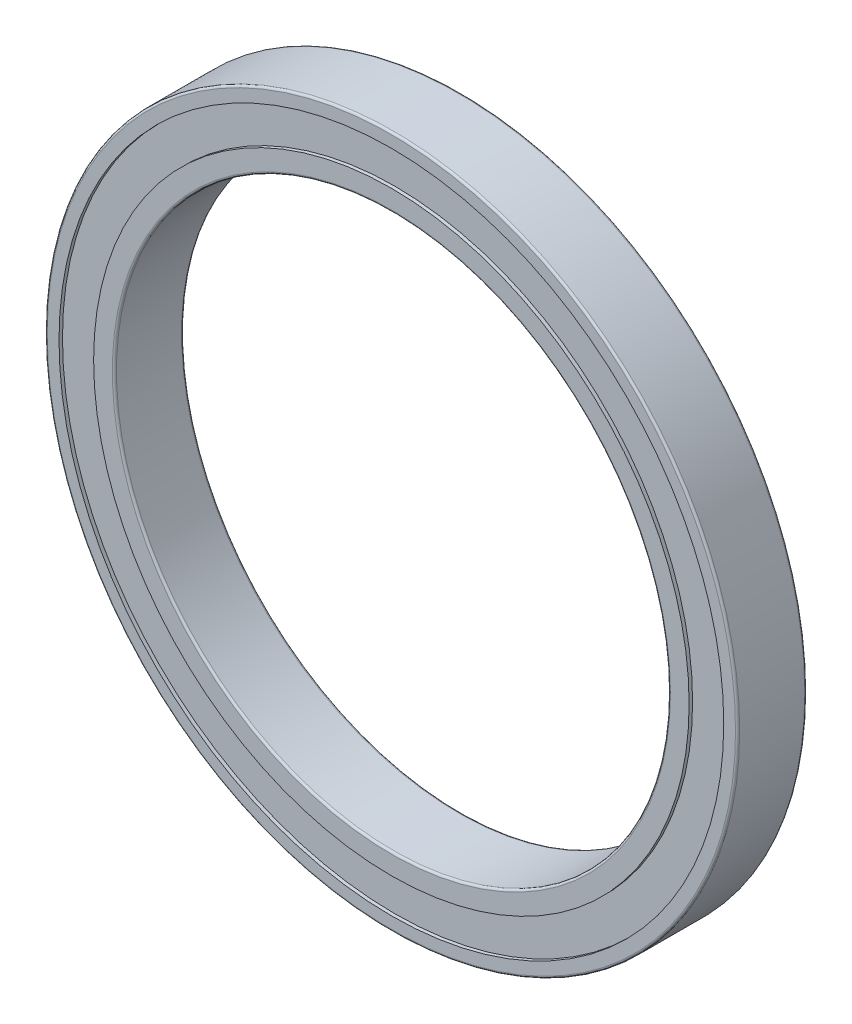
ISO-10303-21;
HEADER;
FILE_DESCRIPTION(('STEP AP214'),'2;1');
FILE_NAME('part.step','',(''),(''),'','','');
FILE_SCHEMA(('AUTOMOTIVE_DESIGN { 1 0 10303 214 1 1 1 1 }'));
ENDSEC;
DATA;
#1=APPLICATION_CONTEXT('core data for automotive mechanical design processes');
#2=APPLICATION_PROTOCOL_DEFINITION('international standard','automotive_design',2000,#1);
#3=PRODUCT_CONTEXT('',#1,'mechanical');
#4=PRODUCT('Part','Part','',(#3));
#5=PRODUCT_RELATED_PRODUCT_CATEGORY('part','',(#4));
#6=PRODUCT_DEFINITION_FORMATION('','',#4);
#7=PRODUCT_DEFINITION_CONTEXT('part definition',#1,'design');
#8=PRODUCT_DEFINITION('design','',#6,#7);
#9=PRODUCT_DEFINITION_SHAPE('','',#8);
#10=(LENGTH_UNIT() NAMED_UNIT(*) SI_UNIT(.MILLI.,.METRE.));
#11=(NAMED_UNIT(*) PLANE_ANGLE_UNIT() SI_UNIT($,.RADIAN.));
#12=(NAMED_UNIT(*) SI_UNIT($,.STERADIAN.) SOLID_ANGLE_UNIT());
#13=UNCERTAINTY_MEASURE_WITH_UNIT(LENGTH_MEASURE(1.E-05),#10,'distance_accuracy_value','');
#14=(GEOMETRIC_REPRESENTATION_CONTEXT(3) GLOBAL_UNCERTAINTY_ASSIGNED_CONTEXT((#13)) GLOBAL_UNIT_ASSIGNED_CONTEXT((#10,
#11,#12)) REPRESENTATION_CONTEXT('',''));
#15=CARTESIAN_POINT('',(0.,0.,0.));
#16=DIRECTION('',(0.,0.,1.));
#17=DIRECTION('',(1.,0.,0.));
#18=AXIS2_PLACEMENT_3D('',#15,#16,#17);
#19=CARTESIAN_POINT('',(0.,0.,0.));
#20=DIRECTION('',(0.,0.,1.));
#21=DIRECTION('',(1.,0.,0.));
#22=AXIS2_PLACEMENT_3D('',#19,#20,#21);
#23=PLANE('',#22);
#24=CARTESIAN_POINT('',(0.,0.,0.));
#25=DIRECTION('',(0.,0.,1.));
#26=DIRECTION('',(1.,0.,0.));
#27=AXIS2_PLACEMENT_3D('',#24,#25,#26);
#28=CIRCLE('',#27,40.3);
#29=CARTESIAN_POINT('',(40.3,0.,0.));
#30=VERTEX_POINT('',#29);
#31=EDGE_CURVE('E75',#30,#30,#28,.T.);
#32=ORIENTED_EDGE('',*,*,#31,.T.);
#33=EDGE_LOOP('',(#32));
#34=FACE_BOUND('',#33,.T.);
#35=CARTESIAN_POINT('',(0.,0.,0.));
#36=DIRECTION('',(0.,0.,-1.));
#37=DIRECTION('',(-1.,0.,0.));
#38=AXIS2_PLACEMENT_3D('',#35,#36,#37);
#39=CIRCLE('',#38,43.);
#40=CARTESIAN_POINT('',(-43.,0.,0.));
#41=VERTEX_POINT('',#40);
#42=EDGE_CURVE('E104',#41,#41,#39,.T.);
#43=ORIENTED_EDGE('',*,*,#42,.T.);
#44=EDGE_LOOP('',(#43));
#45=FACE_BOUND('',#44,.T.);
#46=ADVANCED_FACE('F39',(#34,#45),#23,.F.);
#47=CARTESIAN_POINT('',(0.,0.,10.));
#48=DIRECTION('',(0.,0.,1.));
#49=DIRECTION('',(1.,0.,0.));
#50=AXIS2_PLACEMENT_3D('',#47,#48,#49);
#51=PLANE('',#50);
#52=CARTESIAN_POINT('',(0.,0.,10.));
#53=DIRECTION('',(0.,0.,1.));
#54=DIRECTION('',(1.,0.,0.));
#55=AXIS2_PLACEMENT_3D('',#52,#53,#54);
#56=CIRCLE('',#55,40.3);
#57=CARTESIAN_POINT('',(40.3,0.,10.));
#58=VERTEX_POINT('',#57);
#59=EDGE_CURVE('E63',#58,#58,#56,.F.);
#60=ORIENTED_EDGE('',*,*,#59,.T.);
#61=EDGE_LOOP('',(#60));
#62=FACE_BOUND('',#61,.T.);
#63=CARTESIAN_POINT('',(0.,0.,10.));
#64=DIRECTION('',(0.,0.,1.));
#65=DIRECTION('',(1.,0.,0.));
#66=AXIS2_PLACEMENT_3D('',#63,#64,#65);
#67=CIRCLE('',#66,43.);
#68=CARTESIAN_POINT('',(43.,0.,10.));
#69=VERTEX_POINT('',#68);
#70=EDGE_CURVE('E88',#69,#69,#67,.T.);
#71=ORIENTED_EDGE('',*,*,#70,.T.);
#72=EDGE_LOOP('',(#71));
#73=FACE_BOUND('',#72,.T.);
#74=ADVANCED_FACE('F140',(#62,#73),#51,.T.);
#75=CARTESIAN_POINT('',(0.,0.,10.));
#76=DIRECTION('',(0.,0.,1.));
#77=DIRECTION('',(1.,0.,0.));
#78=AXIS2_PLACEMENT_3D('',#75,#76,#77);
#79=CIRCLE('',#78,49.7);
#80=CARTESIAN_POINT('',(49.7,0.,10.));
#81=VERTEX_POINT('',#80);
#82=EDGE_CURVE('E10',#81,#81,#79,.T.);
#83=ORIENTED_EDGE('',*,*,#82,.T.);
#84=EDGE_LOOP('',(#83));
#85=FACE_BOUND('',#84,.T.);
#86=CARTESIAN_POINT('',(0.,0.,10.));
#87=DIRECTION('',(0.,0.,1.));
#88=DIRECTION('',(1.,0.,0.));
#89=AXIS2_PLACEMENT_3D('',#86,#87,#88);
#90=CIRCLE('',#89,48.);
#91=CARTESIAN_POINT('',(48.,0.,10.));
#92=VERTEX_POINT('',#91);
#93=EDGE_CURVE('E80',#92,#92,#90,.T.);
#94=ORIENTED_EDGE('',*,*,#93,.F.);
#95=EDGE_LOOP('',(#94));
#96=FACE_BOUND('',#95,.T.);
#97=ADVANCED_FACE('F131',(#85,#96),#51,.T.);
#98=CARTESIAN_POINT('',(0.,0.,0.));
#99=DIRECTION('',(0.,0.,1.));
#100=DIRECTION('',(1.,0.,0.));
#101=AXIS2_PLACEMENT_3D('',#98,#99,#100);
#102=CIRCLE('',#101,49.7);
#103=CARTESIAN_POINT('',(49.7,0.,0.));
#104=VERTEX_POINT('',#103);
#105=EDGE_CURVE('E47',#104,#104,#102,.F.);
#106=ORIENTED_EDGE('',*,*,#105,.T.);
#107=EDGE_LOOP('',(#106));
#108=FACE_BOUND('',#107,.T.);
#109=CARTESIAN_POINT('',(0.,0.,0.));
#110=DIRECTION('',(0.,0.,-1.));
#111=DIRECTION('',(-1.,0.,0.));
#112=AXIS2_PLACEMENT_3D('',#109,#110,#111);
#113=CIRCLE('',#112,48.);
#114=CARTESIAN_POINT('',(-48.,0.,0.));
#115=VERTEX_POINT('',#114);
#116=EDGE_CURVE('E96',#115,#115,#113,.T.);
#117=ORIENTED_EDGE('',*,*,#116,.F.);
#118=EDGE_LOOP('',(#117));
#119=FACE_BOUND('',#118,.T.);
#120=ADVANCED_FACE('F128',(#108,#119),#23,.F.);
#121=CARTESIAN_POINT('',(0.,0.,10.));
#122=DIRECTION('',(0.,0.,-1.));
#123=DIRECTION('',(-1.,0.,0.));
#124=AXIS2_PLACEMENT_3D('',#121,#122,#123);
#125=CYLINDRICAL_SURFACE('',#124,50.);
#126=CARTESIAN_POINT('',(0.,0.,0.3));
#127=DIRECTION('',(0.,0.,1.));
#128=DIRECTION('',(1.,0.,0.));
#129=AXIS2_PLACEMENT_3D('',#126,#127,#128);
#130=CIRCLE('',#129,50.);
#131=CARTESIAN_POINT('',(50.,0.,0.3));
#132=VERTEX_POINT('',#131);
#133=EDGE_CURVE('E52',#132,#132,#130,.T.);
#134=ORIENTED_EDGE('',*,*,#133,.T.);
#135=EDGE_LOOP('',(#134));
#136=FACE_BOUND('',#135,.T.);
#137=CARTESIAN_POINT('',(0.,0.,9.7));
#138=DIRECTION('',(0.,0.,1.));
#139=DIRECTION('',(1.,0.,0.));
#140=AXIS2_PLACEMENT_3D('',#137,#138,#139);
#141=CIRCLE('',#140,50.);
#142=CARTESIAN_POINT('',(50.,0.,9.7));
#143=VERTEX_POINT('',#142);
#144=EDGE_CURVE('E57',#143,#143,#141,.F.);
#145=ORIENTED_EDGE('',*,*,#144,.T.);
#146=EDGE_LOOP('',(#145));
#147=FACE_BOUND('',#146,.T.);
#148=ADVANCED_FACE('F130',(#136,#147),#125,.T.);
#149=CARTESIAN_POINT('',(0.,0.,10.));
#150=DIRECTION('',(0.,0.,-1.));
#151=DIRECTION('',(-1.,0.,0.));
#152=AXIS2_PLACEMENT_3D('',#149,#150,#151);
#153=CYLINDRICAL_SURFACE('',#152,40.);
#154=CARTESIAN_POINT('',(0.,0.,0.3));
#155=DIRECTION('',(0.,0.,1.));
#156=DIRECTION('',(1.,0.,0.));
#157=AXIS2_PLACEMENT_3D('',#154,#155,#156);
#158=CIRCLE('',#157,40.);
#159=CARTESIAN_POINT('',(40.,0.,0.3));
#160=VERTEX_POINT('',#159);
#161=EDGE_CURVE('E67',#160,#160,#158,.F.);
#162=ORIENTED_EDGE('',*,*,#161,.T.);
#163=EDGE_LOOP('',(#162));
#164=FACE_BOUND('',#163,.T.);
#165=CARTESIAN_POINT('',(0.,0.,9.7));
#166=DIRECTION('',(0.,0.,1.));
#167=DIRECTION('',(1.,0.,0.));
#168=AXIS2_PLACEMENT_3D('',#165,#166,#167);
#169=CIRCLE('',#168,40.);
#170=CARTESIAN_POINT('',(40.,0.,9.7));
#171=VERTEX_POINT('',#170);
#172=EDGE_CURVE('E71',#171,#171,#169,.T.);
#173=ORIENTED_EDGE('',*,*,#172,.T.);
#174=EDGE_LOOP('',(#173));
#175=FACE_BOUND('',#174,.T.);
#176=ADVANCED_FACE('F137',(#164,#175),#153,.F.);
#177=CARTESIAN_POINT('',(0.,0.,9.5));
#178=DIRECTION('',(0.,0.,1.));
#179=DIRECTION('',(1.,0.,0.));
#180=AXIS2_PLACEMENT_3D('',#177,#178,#179);
#181=CYLINDRICAL_SURFACE('',#180,48.);
#182=CARTESIAN_POINT('',(0.,0.,9.5));
#183=DIRECTION('',(0.,0.,1.));
#184=DIRECTION('',(1.,0.,0.));
#185=AXIS2_PLACEMENT_3D('',#182,#183,#184);
#186=CIRCLE('',#185,48.);
#187=CARTESIAN_POINT('',(48.,0.,9.5));
#188=VERTEX_POINT('',#187);
#189=EDGE_CURVE('E79',#188,#188,#186,.T.);
#190=ORIENTED_EDGE('',*,*,#189,.F.);
#191=EDGE_LOOP('',(#190));
#192=FACE_BOUND('',#191,.T.);
#193=ORIENTED_EDGE('',*,*,#93,.T.);
#194=EDGE_LOOP('',(#193));
#195=FACE_BOUND('',#194,.T.);
#196=ADVANCED_FACE('F167',(#192,#195),#181,.F.);
#197=CARTESIAN_POINT('',(0.,0.,9.5));
#198=DIRECTION('',(0.,0.,1.));
#199=DIRECTION('',(1.,0.,0.));
#200=AXIS2_PLACEMENT_3D('',#197,#198,#199);
#201=PLANE('',#200);
#202=CARTESIAN_POINT('',(0.,0.,9.5));
#203=DIRECTION('',(0.,0.,1.));
#204=DIRECTION('',(1.,0.,0.));
#205=AXIS2_PLACEMENT_3D('',#202,#203,#204);
#206=CIRCLE('',#205,43.);
#207=CARTESIAN_POINT('',(43.,0.,9.5));
#208=VERTEX_POINT('',#207);
#209=EDGE_CURVE('E84',#208,#208,#206,.T.);
#210=ORIENTED_EDGE('',*,*,#209,.F.);
#211=EDGE_LOOP('',(#210));
#212=FACE_BOUND('',#211,.T.);
#213=ORIENTED_EDGE('',*,*,#189,.T.);
#214=EDGE_LOOP('',(#213));
#215=FACE_BOUND('',#214,.T.);
#216=ADVANCED_FACE('F163',(#212,#215),#201,.T.);
#217=CARTESIAN_POINT('',(0.,0.,9.5));
#218=DIRECTION('',(0.,0.,1.));
#219=DIRECTION('',(1.,0.,0.));
#220=AXIS2_PLACEMENT_3D('',#217,#218,#219);
#221=CYLINDRICAL_SURFACE('',#220,43.);
#222=ORIENTED_EDGE('',*,*,#209,.T.);
#223=EDGE_LOOP('',(#222));
#224=FACE_BOUND('',#223,.T.);
#225=ORIENTED_EDGE('',*,*,#70,.F.);
#226=EDGE_LOOP('',(#225));
#227=FACE_BOUND('',#226,.T.);
#228=ADVANCED_FACE('F124',(#224,#227),#221,.T.);
#229=CARTESIAN_POINT('',(0.,0.,0.5));
#230=DIRECTION('',(0.,0.,-1.));
#231=DIRECTION('',(-1.,0.,0.));
#232=AXIS2_PLACEMENT_3D('',#229,#230,#231);
#233=CYLINDRICAL_SURFACE('',#232,48.);
#234=CARTESIAN_POINT('',(0.,0.,0.5));
#235=DIRECTION('',(0.,0.,-1.));
#236=DIRECTION('',(-1.,0.,0.));
#237=AXIS2_PLACEMENT_3D('',#234,#235,#236);
#238=CIRCLE('',#237,48.);
#239=CARTESIAN_POINT('',(-48.,0.,0.5));
#240=VERTEX_POINT('',#239);
#241=EDGE_CURVE('E92',#240,#240,#238,.T.);
#242=ORIENTED_EDGE('',*,*,#241,.F.);
#243=EDGE_LOOP('',(#242));
#244=FACE_BOUND('',#243,.T.);
#245=ORIENTED_EDGE('',*,*,#116,.T.);
#246=EDGE_LOOP('',(#245));
#247=FACE_BOUND('',#246,.T.);
#248=ADVANCED_FACE('F118',(#244,#247),#233,.F.);
#249=CARTESIAN_POINT('',(0.,0.,0.5));
#250=DIRECTION('',(0.,0.,-1.));
#251=DIRECTION('',(-1.,0.,0.));
#252=AXIS2_PLACEMENT_3D('',#249,#250,#251);
#253=PLANE('',#252);
#254=CARTESIAN_POINT('',(0.,0.,0.5));
#255=DIRECTION('',(0.,0.,-1.));
#256=DIRECTION('',(-1.,0.,0.));
#257=AXIS2_PLACEMENT_3D('',#254,#255,#256);
#258=CIRCLE('',#257,43.);
#259=CARTESIAN_POINT('',(-43.,0.,0.5));
#260=VERTEX_POINT('',#259);
#261=EDGE_CURVE('E100',#260,#260,#258,.T.);
#262=ORIENTED_EDGE('',*,*,#261,.F.);
#263=EDGE_LOOP('',(#262));
#264=FACE_BOUND('',#263,.T.);
#265=ORIENTED_EDGE('',*,*,#241,.T.);
#266=EDGE_LOOP('',(#265));
#267=FACE_BOUND('',#266,.T.);
#268=ADVANCED_FACE('F115',(#264,#267),#253,.T.);
#269=CARTESIAN_POINT('',(0.,0.,0.5));
#270=DIRECTION('',(0.,0.,-1.));
#271=DIRECTION('',(-1.,0.,0.));
#272=AXIS2_PLACEMENT_3D('',#269,#270,#271);
#273=CYLINDRICAL_SURFACE('',#272,43.);
#274=ORIENTED_EDGE('',*,*,#261,.T.);
#275=EDGE_LOOP('',(#274));
#276=FACE_BOUND('',#275,.T.);
#277=ORIENTED_EDGE('',*,*,#42,.F.);
#278=EDGE_LOOP('',(#277));
#279=FACE_BOUND('',#278,.T.);
#280=ADVANCED_FACE('F112',(#276,#279),#273,.T.);
#281=CARTESIAN_POINT('',(0.,0.,0.3));
#282=DIRECTION('',(0.,0.,1.));
#283=DIRECTION('',(1.,0.,0.));
#284=AXIS2_PLACEMENT_3D('',#281,#282,#283);
#285=TOROIDAL_SURFACE('',#284,40.3,0.3);
#286=ORIENTED_EDGE('',*,*,#161,.F.);
#287=EDGE_LOOP('',(#286));
#288=FACE_BOUND('',#287,.T.);
#289=ORIENTED_EDGE('',*,*,#31,.F.);
#290=EDGE_LOOP('',(#289));
#291=FACE_BOUND('',#290,.T.);
#292=ADVANCED_FACE('F152',(#288,#291),#285,.T.);
#293=CARTESIAN_POINT('',(0.,0.,9.7));
#294=DIRECTION('',(0.,0.,1.));
#295=DIRECTION('',(1.,0.,0.));
#296=AXIS2_PLACEMENT_3D('',#293,#294,#295);
#297=TOROIDAL_SURFACE('',#296,40.3,0.3);
#298=ORIENTED_EDGE('',*,*,#59,.F.);
#299=EDGE_LOOP('',(#298));
#300=FACE_BOUND('',#299,.T.);
#301=ORIENTED_EDGE('',*,*,#172,.F.);
#302=EDGE_LOOP('',(#301));
#303=FACE_BOUND('',#302,.T.);
#304=ADVANCED_FACE('F157',(#300,#303),#297,.T.);
#305=CARTESIAN_POINT('',(0.,0.,0.3));
#306=DIRECTION('',(0.,0.,1.));
#307=DIRECTION('',(1.,0.,0.));
#308=AXIS2_PLACEMENT_3D('',#305,#306,#307);
#309=TOROIDAL_SURFACE('',#308,49.7,0.3);
#310=ORIENTED_EDGE('',*,*,#105,.F.);
#311=EDGE_LOOP('',(#310));
#312=FACE_BOUND('',#311,.T.);
#313=ORIENTED_EDGE('',*,*,#133,.F.);
#314=EDGE_LOOP('',(#313));
#315=FACE_BOUND('',#314,.T.);
#316=ADVANCED_FACE('F181',(#312,#315),#309,.T.);
#317=CARTESIAN_POINT('',(0.,0.,9.7));
#318=DIRECTION('',(0.,0.,1.));
#319=DIRECTION('',(1.,0.,0.));
#320=AXIS2_PLACEMENT_3D('',#317,#318,#319);
#321=TOROIDAL_SURFACE('',#320,49.7,0.3);
#322=ORIENTED_EDGE('',*,*,#144,.F.);
#323=EDGE_LOOP('',(#322));
#324=FACE_BOUND('',#323,.T.);
#325=ORIENTED_EDGE('',*,*,#82,.F.);
#326=EDGE_LOOP('',(#325));
#327=FACE_BOUND('',#326,.T.);
#328=ADVANCED_FACE('F41',(#324,#327),#321,.T.);
#329=CLOSED_SHELL('',(#46,#74,#97,#120,#148,#176,#196,#216,#228,#248,#268,#280,#292,#304,#316,#328));
#330=MANIFOLD_SOLID_BREP('B2',#329);
#331=ADVANCED_BREP_SHAPE_REPRESENTATION('',(#18,#330),#14);
#332=SHAPE_DEFINITION_REPRESENTATION(#9,#331);
ENDSEC;
END-ISO-10303-21;
